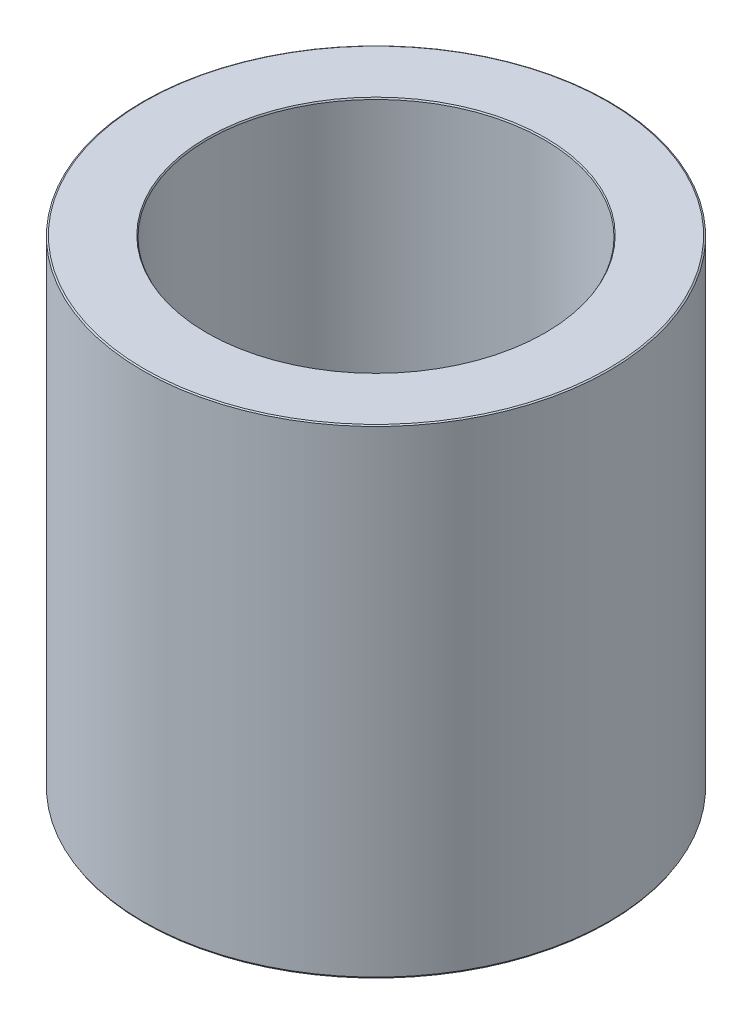
ISO-10303-21;
HEADER;
FILE_DESCRIPTION(('STEP AP214'),'2;1');
FILE_NAME('part.step','',(''),(''),'','','');
FILE_SCHEMA(('AUTOMOTIVE_DESIGN { 1 0 10303 214 1 1 1 1 }'));
ENDSEC;
DATA;
#1=APPLICATION_CONTEXT('core data for automotive mechanical design processes');
#2=APPLICATION_PROTOCOL_DEFINITION('international standard','automotive_design',2000,#1);
#3=PRODUCT_CONTEXT('',#1,'mechanical');
#4=PRODUCT('Part','Part','',(#3));
#5=PRODUCT_RELATED_PRODUCT_CATEGORY('part','',(#4));
#6=PRODUCT_DEFINITION_FORMATION('','',#4);
#7=PRODUCT_DEFINITION_CONTEXT('part definition',#1,'design');
#8=PRODUCT_DEFINITION('design','',#6,#7);
#9=PRODUCT_DEFINITION_SHAPE('','',#8);
#10=(LENGTH_UNIT() NAMED_UNIT(*) SI_UNIT(.MILLI.,.METRE.));
#11=(NAMED_UNIT(*) PLANE_ANGLE_UNIT() SI_UNIT($,.RADIAN.));
#12=(NAMED_UNIT(*) SI_UNIT($,.STERADIAN.) SOLID_ANGLE_UNIT());
#13=UNCERTAINTY_MEASURE_WITH_UNIT(LENGTH_MEASURE(1.E-05),#10,'distance_accuracy_value','');
#14=(GEOMETRIC_REPRESENTATION_CONTEXT(3) GLOBAL_UNCERTAINTY_ASSIGNED_CONTEXT((#13)) GLOBAL_UNIT_ASSIGNED_CONTEXT((#10,
#11,#12)) REPRESENTATION_CONTEXT('',''));
#15=CARTESIAN_POINT('',(0.,0.,0.));
#16=DIRECTION('',(0.,0.,1.));
#17=DIRECTION('',(1.,0.,0.));
#18=AXIS2_PLACEMENT_3D('',#15,#16,#17);
#19=CARTESIAN_POINT('',(0.,123.336227730145,0.));
#20=DIRECTION('',(0.,-1.,0.));
#21=DIRECTION('',(0.,0.,-1.));
#22=AXIS2_PLACEMENT_3D('',#19,#20,#21);
#23=CYLINDRICAL_SURFACE('',#22,60.);
#24=CARTESIAN_POINT('',(0.,0.366332525937443,0.));
#25=DIRECTION('',(0.,1.,0.));
#26=DIRECTION('',(0.,0.,1.));
#27=AXIS2_PLACEMENT_3D('',#24,#25,#26);
#28=CIRCLE('',#27,60.);
#29=CARTESIAN_POINT('',(0.,0.366332525937443,-60.));
#30=VERTEX_POINT('',#29);
#31=EDGE_CURVE('E10',#30,#30,#28,.T.);
#32=CARTESIAN_POINT('',(0.,123.124725547683,0.));
#33=DIRECTION('',(0.,1.,0.));
#34=DIRECTION('',(0.,0.,1.));
#35=AXIS2_PLACEMENT_3D('',#32,#33,#34);
#36=CIRCLE('',#35,60.);
#37=CARTESIAN_POINT('',(0.,123.124725547683,-60.));
#38=VERTEX_POINT('',#37);
#39=EDGE_CURVE('E50',#38,#38,#36,.F.);
#40=CARTESIAN_POINT('',(0.,0.366332525937443,-60.));
#41=CARTESIAN_POINT('',(0.,1.64506578658063,-60.));
#42=CARTESIAN_POINT('',(0.,2.92379904722381,-60.));
#43=CARTESIAN_POINT('',(0.,5.48126556851017,-60.));
#44=CARTESIAN_POINT('',(0.,6.75999882915335,-60.));
#45=CARTESIAN_POINT('',(0.,9.31746535043971,-60.));
#46=CARTESIAN_POINT('',(0.,10.5961986110829,-60.));
#47=CARTESIAN_POINT('',(0.,13.1536651323692,-60.));
#48=CARTESIAN_POINT('',(0.,14.4323983930124,-60.));
#49=CARTESIAN_POINT('',(0.,16.9898649142988,-60.));
#50=CARTESIAN_POINT('',(0.,18.268598174942,-60.));
#51=CARTESIAN_POINT('',(0.,20.8260646962283,-60.));
#52=CARTESIAN_POINT('',(0.,22.1047979568715,-60.));
#53=CARTESIAN_POINT('',(0.,24.6622644781579,-60.));
#54=CARTESIAN_POINT('',(0.,25.9409977388011,-60.));
#55=CARTESIAN_POINT('',(0.,28.4984642600874,-60.));
#56=CARTESIAN_POINT('',(0.,29.7771975207306,-60.));
#57=CARTESIAN_POINT('',(0.,32.334664042017,-60.));
#58=CARTESIAN_POINT('',(0.,33.6133973026601,-60.));
#59=CARTESIAN_POINT('',(0.,36.1708638239465,-60.));
#60=CARTESIAN_POINT('',(0.,37.4495970845897,-60.));
#61=CARTESIAN_POINT('',(0.,40.007063605876,-60.));
#62=CARTESIAN_POINT('',(0.,41.2857968665192,-60.));
#63=CARTESIAN_POINT('',(0.,43.8432633878056,-60.));
#64=CARTESIAN_POINT('',(0.,45.1219966484488,-60.));
#65=CARTESIAN_POINT('',(0.,47.6794631697351,-60.));
#66=CARTESIAN_POINT('',(0.,48.9581964303783,-60.));
#67=CARTESIAN_POINT('',(0.,51.5156629516647,-60.));
#68=CARTESIAN_POINT('',(0.,52.7943962123078,-60.));
#69=CARTESIAN_POINT('',(0.,55.3518627335942,-60.));
#70=CARTESIAN_POINT('',(0.,56.6305959942374,-60.));
#71=CARTESIAN_POINT('',(0.,59.1880625155237,-60.));
#72=CARTESIAN_POINT('',(0.,60.4667957761669,-60.));
#73=CARTESIAN_POINT('',(0.,63.0242622974533,-60.));
#74=CARTESIAN_POINT('',(0.,64.3029955580965,-60.));
#75=CARTESIAN_POINT('',(0.,66.8604620793828,-60.));
#76=CARTESIAN_POINT('',(0.,68.139195340026,-60.));
#77=CARTESIAN_POINT('',(0.,70.6966618613124,-60.));
#78=CARTESIAN_POINT('',(0.,71.9753951219555,-60.));
#79=CARTESIAN_POINT('',(0.,74.5328616432419,-60.));
#80=CARTESIAN_POINT('',(0.,75.8115949038851,-60.));
#81=CARTESIAN_POINT('',(0.,78.3690614251714,-60.));
#82=CARTESIAN_POINT('',(0.,79.6477946858146,-60.));
#83=CARTESIAN_POINT('',(0.,82.205261207101,-60.));
#84=CARTESIAN_POINT('',(0.,83.4839944677442,-60.));
#85=CARTESIAN_POINT('',(0.,86.0414609890305,-60.));
#86=CARTESIAN_POINT('',(0.,87.3201942496737,-60.));
#87=CARTESIAN_POINT('',(0.,89.8776607709601,-60.));
#88=CARTESIAN_POINT('',(0.,91.1563940316033,-60.));
#89=CARTESIAN_POINT('',(0.,93.7138605528896,-60.));
#90=CARTESIAN_POINT('',(0.,94.9925938135328,-60.));
#91=CARTESIAN_POINT('',(0.,97.5500603348191,-60.));
#92=CARTESIAN_POINT('',(0.,98.8287935954623,-60.));
#93=CARTESIAN_POINT('',(0.,101.386260116749,-60.));
#94=CARTESIAN_POINT('',(0.,102.664993377392,-60.));
#95=CARTESIAN_POINT('',(0.,105.222459898678,-60.));
#96=CARTESIAN_POINT('',(0.,106.501193159321,-60.));
#97=CARTESIAN_POINT('',(0.,109.058659680608,-60.));
#98=CARTESIAN_POINT('',(0.,110.337392941251,-60.));
#99=CARTESIAN_POINT('',(0.,112.894859462537,-60.));
#100=CARTESIAN_POINT('',(0.,114.17359272318,-60.));
#101=CARTESIAN_POINT('',(0.,116.731059244467,-60.));
#102=CARTESIAN_POINT('',(0.,118.00979250511,-60.));
#103=CARTESIAN_POINT('',(0.,120.567259026396,-60.));
#104=CARTESIAN_POINT('',(0.,121.84599228704,-60.));
#105=CARTESIAN_POINT('',(0.,123.124725547683,-60.));
#106=B_SPLINE_CURVE_WITH_KNOTS('',3,(#40,#41,#42,#43,#44,#45,#46,#47,#48,#49,#50,#51,#52,#53,
#54,#55,#56,#57,#58,#59,#60,#61,#62,#63,#64,#65,#66,#67,#68,#69,#70,#71,#72,#73,#74,#75,#76,#77,
#78,#79,#80,#81,#82,#83,#84,#85,#86,#87,#88,#89,#90,#91,#92,#93,#94,#95,#96,#97,#98,#99,#100,
#101,#102,#103,#104,#105),.UNSPECIFIED.,.F.,.F.,(4,2,2,2,2,2,2,2,2,2,2,2,2,2,2,2,2,2,2,2,2,2,2,
2,2,2,2,2,2,2,2,2,4),(0.,3.83619978192955,7.67239956385908,11.5085993457886,15.3447991277182,
19.1809989096477,23.0171986915773,26.8533984735068,30.6895982554363,34.5257980373659,
38.3619978192954,42.198197601225,46.0343973831545,49.870597165084,53.7067969470136,
57.5429967289431,61.3791965108727,65.2153962928022,69.0515960747317,72.8877958566613,
76.7239956385908,80.5601954205204,84.3963952024499,88.2325949843794,92.068794766309,
95.9049945482385,99.7411943301681,103.577394112098,107.413593894027,111.249793675957,
115.085993457886,118.922193239816,122.758393021745),.UNSPECIFIED.);
#107=EDGE_CURVE('BSEAM39',#30,#38,#106,.T.);
#108=ORIENTED_EDGE('',*,*,#31,.T.);
#109=ORIENTED_EDGE('',*,*,#39,.T.);
#110=ORIENTED_EDGE('',*,*,#107,.T.);
#111=ORIENTED_EDGE('',*,*,#107,.F.);
#112=EDGE_LOOP('',(#108,#110,#109,#111));
#113=FACE_BOUND('',#112,.T.);
#114=ADVANCED_FACE('F39',(#113),#23,.T.);
#115=CARTESIAN_POINT('',(0.,123.336227730145,0.));
#116=DIRECTION('',(0.,1.,0.));
#117=DIRECTION('',(0.,0.,1.));
#118=AXIS2_PLACEMENT_3D('',#115,#116,#117);
#119=PLANE('',#118);
#120=CARTESIAN_POINT('',(0.,123.336227730145,0.));
#121=DIRECTION('',(0.,1.,0.));
#122=DIRECTION('',(0.,0.,1.));
#123=AXIS2_PLACEMENT_3D('',#120,#121,#122);
#124=CIRCLE('',#123,43.542781134796);
#125=CARTESIAN_POINT('',(0.,123.336227730145,43.542781134796));
#126=VERTEX_POINT('',#125);
#127=EDGE_CURVE('E58',#126,#126,#124,.F.);
#128=ORIENTED_EDGE('',*,*,#127,.T.);
#129=EDGE_LOOP('',(#128));
#130=FACE_BOUND('',#129,.T.);
#131=CARTESIAN_POINT('',(0.,123.336227730145,0.));
#132=DIRECTION('',(0.,1.,0.));
#133=DIRECTION('',(0.,0.,1.));
#134=AXIS2_PLACEMENT_3D('',#131,#132,#133);
#135=CIRCLE('',#134,59.6336674740631);
#136=CARTESIAN_POINT('',(0.,123.336227730145,59.6336674740631));
#137=VERTEX_POINT('',#136);
#138=EDGE_CURVE('E61',#137,#137,#135,.T.);
#139=ORIENTED_EDGE('',*,*,#138,.T.);
#140=EDGE_LOOP('',(#139));
#141=FACE_BOUND('',#140,.T.);
#142=ADVANCED_FACE('F88',(#130,#141),#119,.T.);
#143=CARTESIAN_POINT('',(0.,0.,0.));
#144=DIRECTION('',(0.,1.,0.));
#145=DIRECTION('',(0.,0.,1.));
#146=AXIS2_PLACEMENT_3D('',#143,#144,#145);
#147=PLANE('',#146);
#148=CARTESIAN_POINT('',(0.,0.,0.));
#149=DIRECTION('',(0.,1.,0.));
#150=DIRECTION('',(0.,0.,1.));
#151=AXIS2_PLACEMENT_3D('',#148,#149,#150);
#152=CIRCLE('',#151,43.6976114782701);
#153=CARTESIAN_POINT('',(0.,0.,43.6976114782701));
#154=VERTEX_POINT('',#153);
#155=EDGE_CURVE('E51',#154,#154,#152,.T.);
#156=ORIENTED_EDGE('',*,*,#155,.T.);
#157=EDGE_LOOP('',(#156));
#158=FACE_BOUND('',#157,.T.);
#159=CARTESIAN_POINT('',(0.,0.,0.));
#160=DIRECTION('',(0.,1.,0.));
#161=DIRECTION('',(0.,0.,1.));
#162=AXIS2_PLACEMENT_3D('',#159,#160,#161);
#163=CIRCLE('',#162,59.7884978175371);
#164=CARTESIAN_POINT('',(0.,0.,59.7884978175371));
#165=VERTEX_POINT('',#164);
#166=EDGE_CURVE('E54',#165,#165,#163,.F.);
#167=ORIENTED_EDGE('',*,*,#166,.T.);
#168=EDGE_LOOP('',(#167));
#169=FACE_BOUND('',#168,.T.);
#170=ADVANCED_FACE('F83',(#158,#169),#147,.F.);
#171=CARTESIAN_POINT('',(0.,123.336227730145,0.));
#172=DIRECTION('',(0.,-1.,0.));
#173=DIRECTION('',(0.,0.,-1.));
#174=AXIS2_PLACEMENT_3D('',#171,#172,#173);
#175=CYLINDRICAL_SURFACE('',#174,43.3312789523331);
#176=CARTESIAN_POINT('',(0.,122.969895204208,0.));
#177=DIRECTION('',(0.,1.,0.));
#178=DIRECTION('',(0.,0.,1.));
#179=AXIS2_PLACEMENT_3D('',#176,#177,#178);
#180=CIRCLE('',#179,43.3312789523331);
#181=CARTESIAN_POINT('',(0.,122.969895204208,-43.3312789523331));
#182=VERTEX_POINT('',#181);
#183=EDGE_CURVE('E67',#182,#182,#180,.T.);
#184=CARTESIAN_POINT('',(0.,0.211502182462631,0.));
#185=DIRECTION('',(0.,1.,0.));
#186=DIRECTION('',(0.,0.,1.));
#187=AXIS2_PLACEMENT_3D('',#184,#185,#186);
#188=CIRCLE('',#187,43.3312789523331);
#189=CARTESIAN_POINT('',(0.,0.211502182462617,-43.3312789523331));
#190=VERTEX_POINT('',#189);
#191=EDGE_CURVE('E69',#190,#190,#188,.F.);
#192=CARTESIAN_POINT('',(0.,122.969895204208,-43.3312789523331));
#193=CARTESIAN_POINT('',(0.,121.691161943565,-43.3312789523331));
#194=CARTESIAN_POINT('',(0.,120.412428682922,-43.3312789523331));
#195=CARTESIAN_POINT('',(0.,117.854962161635,-43.3312789523331));
#196=CARTESIAN_POINT('',(0.,116.576228900992,-43.3312789523331));
#197=CARTESIAN_POINT('',(0.,114.018762379706,-43.3312789523331));
#198=CARTESIAN_POINT('',(0.,112.740029119063,-43.3312789523331));
#199=CARTESIAN_POINT('',(0.,110.182562597776,-43.3312789523331));
#200=CARTESIAN_POINT('',(0.,108.903829337133,-43.3312789523331));
#201=CARTESIAN_POINT('',(0.,106.346362815847,-43.3312789523331));
#202=CARTESIAN_POINT('',(0.,105.067629555203,-43.3312789523331));
#203=CARTESIAN_POINT('',(0.,102.510163033917,-43.3312789523331));
#204=CARTESIAN_POINT('',(0.,101.231429773274,-43.3312789523331));
#205=CARTESIAN_POINT('',(0.,98.6739632519875,-43.3312789523331));
#206=CARTESIAN_POINT('',(0.,97.3952299913444,-43.3312789523331));
#207=CARTESIAN_POINT('',(0.,94.837763470058,-43.3312789523331));
#208=CARTESIAN_POINT('',(0.,93.5590302094148,-43.3312789523331));
#209=CARTESIAN_POINT('',(0.,91.0015636881285,-43.3312789523331));
#210=CARTESIAN_POINT('',(0.,89.7228304274853,-43.3312789523331));
#211=CARTESIAN_POINT('',(0.,87.1653639061989,-43.3312789523331));
#212=CARTESIAN_POINT('',(0.,85.8866306455557,-43.3312789523331));
#213=CARTESIAN_POINT('',(0.,83.3291641242694,-43.3312789523331));
#214=CARTESIAN_POINT('',(0.,82.0504308636262,-43.3312789523331));
#215=CARTESIAN_POINT('',(0.,79.4929643423398,-43.3312789523331));
#216=CARTESIAN_POINT('',(0.,78.2142310816966,-43.3312789523331));
#217=CARTESIAN_POINT('',(0.,75.6567645604103,-43.3312789523331));
#218=CARTESIAN_POINT('',(0.,74.3780312997671,-43.3312789523331));
#219=CARTESIAN_POINT('',(0.,71.8205647784808,-43.3312789523331));
#220=CARTESIAN_POINT('',(0.,70.5418315178376,-43.3312789523331));
#221=CARTESIAN_POINT('',(0.,67.9843649965512,-43.3312789523331));
#222=CARTESIAN_POINT('',(0.,66.705631735908,-43.3312789523331));
#223=CARTESIAN_POINT('',(0.,64.1481652146217,-43.3312789523331));
#224=CARTESIAN_POINT('',(0.,62.8694319539785,-43.3312789523331));
#225=CARTESIAN_POINT('',(0.,60.3119654326921,-43.3312789523331));
#226=CARTESIAN_POINT('',(0.,59.0332321720489,-43.3312789523331));
#227=CARTESIAN_POINT('',(0.,56.4757656507626,-43.3312789523331));
#228=CARTESIAN_POINT('',(0.,55.1970323901194,-43.3312789523331));
#229=CARTESIAN_POINT('',(0.,52.639565868833,-43.3312789523331));
#230=CARTESIAN_POINT('',(0.,51.3608326081899,-43.3312789523331));
#231=CARTESIAN_POINT('',(0.,48.8033660869035,-43.3312789523331));
#232=CARTESIAN_POINT('',(0.,47.5246328262603,-43.3312789523331));
#233=CARTESIAN_POINT('',(0.,44.9671663049739,-43.3312789523331));
#234=CARTESIAN_POINT('',(0.,43.6884330443308,-43.3312789523331));
#235=CARTESIAN_POINT('',(0.,41.1309665230444,-43.3312789523331));
#236=CARTESIAN_POINT('',(0.,39.8522332624012,-43.3312789523331));
#237=CARTESIAN_POINT('',(0.,37.2947667411149,-43.3312789523331));
#238=CARTESIAN_POINT('',(0.,36.0160334804717,-43.3312789523331));
#239=CARTESIAN_POINT('',(0.,33.4585669591853,-43.3312789523331));
#240=CARTESIAN_POINT('',(0.,32.1798336985421,-43.3312789523331));
#241=CARTESIAN_POINT('',(0.,29.6223671772558,-43.3312789523331));
#242=CARTESIAN_POINT('',(0.,28.3436339166126,-43.3312789523331));
#243=CARTESIAN_POINT('',(0.,25.7861673953262,-43.3312789523331));
#244=CARTESIAN_POINT('',(0.,24.5074341346831,-43.3312789523331));
#245=CARTESIAN_POINT('',(0.,21.9499676133967,-43.3312789523331));
#246=CARTESIAN_POINT('',(0.,20.6712343527535,-43.3312789523331));
#247=CARTESIAN_POINT('',(0.,18.1137678314671,-43.3312789523331));
#248=CARTESIAN_POINT('',(0.,16.835034570824,-43.3312789523331));
#249=CARTESIAN_POINT('',(0.,14.2775680495376,-43.3312789523331));
#250=CARTESIAN_POINT('',(0.,12.9988347888944,-43.3312789523331));
#251=CARTESIAN_POINT('',(0.,10.4413682676081,-43.3312789523331));
#252=CARTESIAN_POINT('',(0.,9.16263500696488,-43.3312789523331));
#253=CARTESIAN_POINT('',(0.,6.60516848567852,-43.3312789523331));
#254=CARTESIAN_POINT('',(0.,5.32643522503534,-43.3312789523331));
#255=CARTESIAN_POINT('',(0.,2.76896870374898,-43.3312789523331));
#256=CARTESIAN_POINT('',(0.,1.4902354431058,-43.3312789523331));
#257=CARTESIAN_POINT('',(0.,0.211502182462617,-43.3312789523331));
#258=B_SPLINE_CURVE_WITH_KNOTS('',3,(#192,#193,#194,#195,#196,#197,#198,#199,#200,#201,#202,
#203,#204,#205,#206,#207,#208,#209,#210,#211,#212,#213,#214,#215,#216,#217,#218,#219,#220,#221,
#222,#223,#224,#225,#226,#227,#228,#229,#230,#231,#232,#233,#234,#235,#236,#237,#238,#239,#240,
#241,#242,#243,#244,#245,#246,#247,#248,#249,#250,#251,#252,#253,#254,#255,#256,#257),
.UNSPECIFIED.,.F.,.F.,(4,2,2,2,2,2,2,2,2,2,2,2,2,2,2,2,2,2,2,2,2,2,2,2,2,2,2,2,2,2,2,2,4),(0.,
3.83619978192953,7.67239956385908,11.5085993457886,15.3447991277182,19.1809989096477,
23.0171986915772,26.8533984735068,30.6895982554363,34.5257980373659,38.3619978192954,
42.198197601225,46.0343973831545,49.870597165084,53.7067969470136,57.5429967289431,
61.3791965108727,65.2153962928022,69.0515960747318,72.8877958566613,76.7239956385908,
80.5601954205204,84.3963952024499,88.2325949843795,92.068794766309,95.9049945482385,
99.7411943301681,103.577394112098,107.413593894027,111.249793675957,115.085993457886,
118.922193239816,122.758393021745),.UNSPECIFIED.);
#259=EDGE_CURVE('BSEAM71',#182,#190,#258,.T.);
#260=ORIENTED_EDGE('',*,*,#183,.T.);
#261=ORIENTED_EDGE('',*,*,#191,.T.);
#262=ORIENTED_EDGE('',*,*,#259,.T.);
#263=ORIENTED_EDGE('',*,*,#259,.F.);
#264=EDGE_LOOP('',(#260,#262,#261,#263));
#265=FACE_BOUND('',#264,.T.);
#266=ADVANCED_FACE('F71',(#265),#175,.F.);
#267=CARTESIAN_POINT('',(0.,122.969895204208,0.));
#268=DIRECTION('',(0.,1.,0.));
#269=DIRECTION('',(0.,0.,1.));
#270=AXIS2_PLACEMENT_3D('',#267,#268,#269);
#271=CONICAL_SURFACE('',#270,43.3312789523331,0.523598775598287);
#272=ORIENTED_EDGE('',*,*,#127,.F.);
#273=EDGE_LOOP('',(#272));
#274=FACE_BOUND('',#273,.T.);
#275=ORIENTED_EDGE('',*,*,#183,.F.);
#276=EDGE_LOOP('',(#275));
#277=FACE_BOUND('',#276,.T.);
#278=ADVANCED_FACE('F77',(#274,#277),#271,.F.);
#279=CARTESIAN_POINT('',(0.,0.,0.));
#280=DIRECTION('',(0.,-1.,0.));
#281=DIRECTION('',(0.,0.,-1.));
#282=AXIS2_PLACEMENT_3D('',#279,#280,#281);
#283=CONICAL_SURFACE('',#282,43.6976114782701,1.04719755119656);
#284=ORIENTED_EDGE('',*,*,#191,.F.);
#285=EDGE_LOOP('',(#284));
#286=FACE_BOUND('',#285,.T.);
#287=ORIENTED_EDGE('',*,*,#155,.F.);
#288=EDGE_LOOP('',(#287));
#289=FACE_BOUND('',#288,.T.);
#290=ADVANCED_FACE('F73',(#286,#289),#283,.F.);
#291=CARTESIAN_POINT('',(0.,0.366332525937443,0.));
#292=DIRECTION('',(0.,1.,0.));
#293=DIRECTION('',(0.,0.,1.));
#294=AXIS2_PLACEMENT_3D('',#291,#292,#293);
#295=CONICAL_SURFACE('',#294,60.,0.52359877559829);
#296=ORIENTED_EDGE('',*,*,#166,.F.);
#297=EDGE_LOOP('',(#296));
#298=FACE_BOUND('',#297,.T.);
#299=ORIENTED_EDGE('',*,*,#31,.F.);
#300=EDGE_LOOP('',(#299));
#301=FACE_BOUND('',#300,.T.);
#302=ADVANCED_FACE('F76',(#298,#301),#295,.T.);
#303=CARTESIAN_POINT('',(0.,123.336227730145,0.));
#304=DIRECTION('',(0.,-1.,0.));
#305=DIRECTION('',(0.,0.,-1.));
#306=AXIS2_PLACEMENT_3D('',#303,#304,#305);
#307=CONICAL_SURFACE('',#306,59.6336674740631,1.04719755119661);
#308=ORIENTED_EDGE('',*,*,#39,.F.);
#309=EDGE_LOOP('',(#308));
#310=FACE_BOUND('',#309,.T.);
#311=ORIENTED_EDGE('',*,*,#138,.F.);
#312=EDGE_LOOP('',(#311));
#313=FACE_BOUND('',#312,.T.);
#314=ADVANCED_FACE('F45',(#310,#313),#307,.T.);
#315=CLOSED_SHELL('',(#114,#142,#170,#266,#278,#290,#302,#314));
#316=MANIFOLD_SOLID_BREP('B2',#315);
#317=ADVANCED_BREP_SHAPE_REPRESENTATION('',(#18,#316),#14);
#318=SHAPE_DEFINITION_REPRESENTATION(#9,#317);
ENDSEC;
END-ISO-10303-21;
